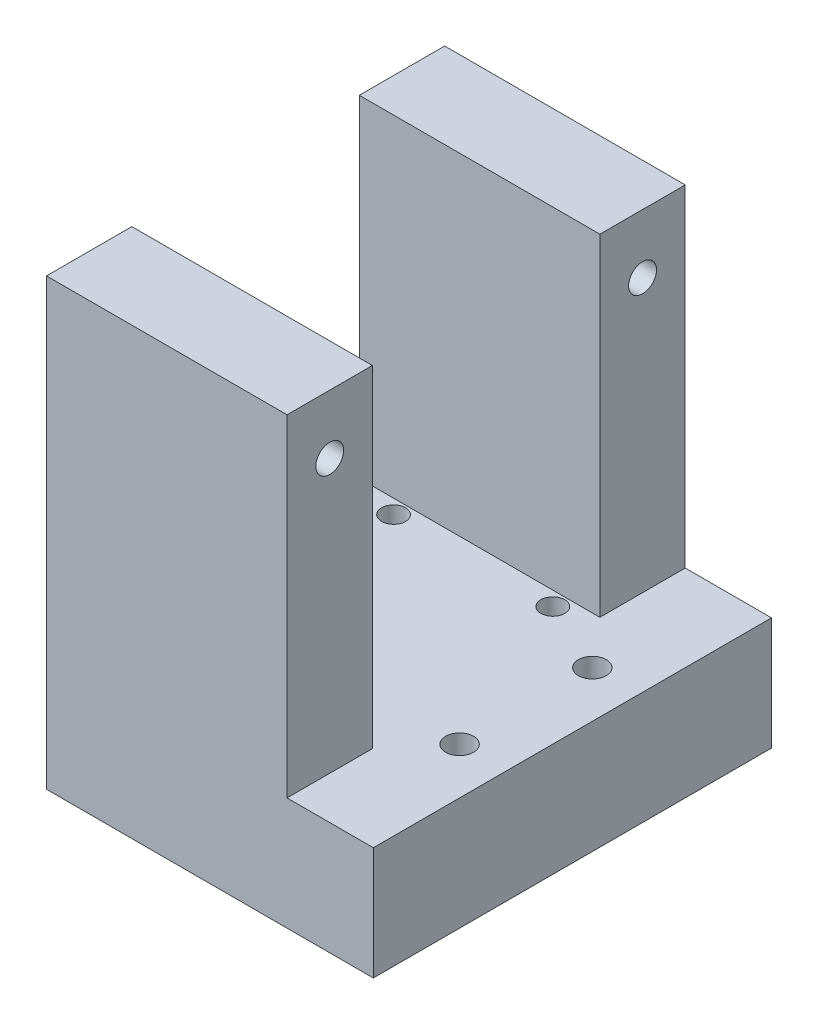
ISO-10303-21;
HEADER;
FILE_DESCRIPTION(('STEP AP214'),'2;1');
FILE_NAME('part.step','',(''),(''),'','','');
FILE_SCHEMA(('AUTOMOTIVE_DESIGN { 1 0 10303 214 1 1 1 1 }'));
ENDSEC;
DATA;
#1=APPLICATION_CONTEXT('core data for automotive mechanical design processes');
#2=APPLICATION_PROTOCOL_DEFINITION('international standard','automotive_design',2000,#1);
#3=PRODUCT_CONTEXT('',#1,'mechanical');
#4=PRODUCT('Part','Part','',(#3));
#5=PRODUCT_RELATED_PRODUCT_CATEGORY('part','',(#4));
#6=PRODUCT_DEFINITION_FORMATION('','',#4);
#7=PRODUCT_DEFINITION_CONTEXT('part definition',#1,'design');
#8=PRODUCT_DEFINITION('design','',#6,#7);
#9=PRODUCT_DEFINITION_SHAPE('','',#8);
#10=(LENGTH_UNIT() NAMED_UNIT(*) SI_UNIT(.MILLI.,.METRE.));
#11=(NAMED_UNIT(*) PLANE_ANGLE_UNIT() SI_UNIT($,.RADIAN.));
#12=(NAMED_UNIT(*) SI_UNIT($,.STERADIAN.) SOLID_ANGLE_UNIT());
#13=UNCERTAINTY_MEASURE_WITH_UNIT(LENGTH_MEASURE(1.E-05),#10,'distance_accuracy_value','');
#14=(GEOMETRIC_REPRESENTATION_CONTEXT(3) GLOBAL_UNCERTAINTY_ASSIGNED_CONTEXT((#13)) GLOBAL_UNIT_ASSIGNED_CONTEXT((#10,
#11,#12)) REPRESENTATION_CONTEXT('',''));
#15=CARTESIAN_POINT('',(0.,0.,0.));
#16=DIRECTION('',(0.,0.,1.));
#17=DIRECTION('',(1.,0.,0.));
#18=AXIS2_PLACEMENT_3D('',#15,#16,#17);
#19=CARTESIAN_POINT('',(0.,17.,0.));
#20=DIRECTION('',(0.,1.,0.));
#21=DIRECTION('',(0.,0.,1.));
#22=AXIS2_PLACEMENT_3D('',#19,#20,#21);
#23=PLANE('',#22);
#24=CARTESIAN_POINT('',(7.3,17.,-35.));
#25=DIRECTION('',(0.,1.,0.));
#26=DIRECTION('',(0.,0.,-1.));
#27=AXIS2_PLACEMENT_3D('',#24,#25,#26);
#28=CIRCLE('',#27,1.8);
#29=CARTESIAN_POINT('',(7.3,17.,-36.8));
#30=VERTEX_POINT('',#29);
#31=EDGE_CURVE('E244',#30,#30,#28,.T.);
#32=ORIENTED_EDGE('',*,*,#31,.F.);
#33=EDGE_LOOP('',(#32));
#34=FACE_BOUND('',#33,.T.);
#35=CARTESIAN_POINT('',(31.3,17.,-5.));
#36=DIRECTION('',(0.,1.,0.));
#37=DIRECTION('',(0.,0.,1.));
#38=AXIS2_PLACEMENT_3D('',#35,#36,#37);
#39=CIRCLE('',#38,1.8);
#40=CARTESIAN_POINT('',(31.3,17.,-3.2));
#41=VERTEX_POINT('',#40);
#42=EDGE_CURVE('E260',#41,#41,#39,.T.);
#43=ORIENTED_EDGE('',*,*,#42,.F.);
#44=EDGE_LOOP('',(#43));
#45=FACE_BOUND('',#44,.T.);
#46=CARTESIAN_POINT('',(7.3,17.,-5.));
#47=DIRECTION('',(0.,1.,0.));
#48=DIRECTION('',(0.,0.,1.));
#49=AXIS2_PLACEMENT_3D('',#46,#47,#48);
#50=CIRCLE('',#49,1.8);
#51=CARTESIAN_POINT('',(7.3,17.,-3.2));
#52=VERTEX_POINT('',#51);
#53=EDGE_CURVE('E276',#52,#52,#50,.T.);
#54=ORIENTED_EDGE('',*,*,#53,.F.);
#55=EDGE_LOOP('',(#54));
#56=FACE_BOUND('',#55,.T.);
#57=CARTESIAN_POINT('',(42.25,17.,-30.));
#58=DIRECTION('',(0.,1.,0.));
#59=DIRECTION('',(0.,0.,1.));
#60=AXIS2_PLACEMENT_3D('',#57,#58,#59);
#61=CIRCLE('',#60,2.1);
#62=CARTESIAN_POINT('',(42.25,17.,-27.9));
#63=VERTEX_POINT('',#62);
#64=EDGE_CURVE('E268',#63,#63,#61,.T.);
#65=ORIENTED_EDGE('',*,*,#64,.F.);
#66=EDGE_LOOP('',(#65));
#67=FACE_BOUND('',#66,.T.);
#68=CARTESIAN_POINT('',(31.3,17.,-35.));
#69=DIRECTION('',(0.,1.,0.));
#70=DIRECTION('',(0.,0.,-1.));
#71=AXIS2_PLACEMENT_3D('',#68,#69,#70);
#72=CIRCLE('',#71,1.8);
#73=CARTESIAN_POINT('',(31.3,17.,-36.8));
#74=VERTEX_POINT('',#73);
#75=EDGE_CURVE('E252',#74,#74,#72,.T.);
#76=ORIENTED_EDGE('',*,*,#75,.F.);
#77=EDGE_LOOP('',(#76));
#78=FACE_BOUND('',#77,.T.);
#79=CARTESIAN_POINT('',(42.25,17.,-10.));
#80=DIRECTION('',(0.,1.,0.));
#81=DIRECTION('',(0.,0.,1.));
#82=AXIS2_PLACEMENT_3D('',#79,#80,#81);
#83=CIRCLE('',#82,2.1);
#84=CARTESIAN_POINT('',(42.25,17.,-7.9));
#85=VERTEX_POINT('',#84);
#86=EDGE_CURVE('E236',#85,#85,#83,.T.);
#87=ORIENTED_EDGE('',*,*,#86,.F.);
#88=EDGE_LOOP('',(#87));
#89=FACE_BOUND('',#88,.T.);
#90=DIRECTION('',(-1.,0.,0.));
#91=VECTOR('',#90,1.);
#92=CARTESIAN_POINT('',(0.,17.,-2.86));
#93=LINE('',#92,#91);
#94=CARTESIAN_POINT('',(36.25,17.,-2.86));
#95=VERTEX_POINT('',#94);
#96=CARTESIAN_POINT('',(0.,17.,-2.86));
#97=VERTEX_POINT('',#96);
#98=EDGE_CURVE('E58',#95,#97,#93,.T.);
#99=ORIENTED_EDGE('',*,*,#98,.F.);
#100=DIRECTION('',(0.,0.,-1.));
#101=VECTOR('',#100,1.);
#102=CARTESIAN_POINT('',(36.25,17.,-2.86));
#103=LINE('',#102,#101);
#104=CARTESIAN_POINT('',(36.25,17.,10.));
#105=VERTEX_POINT('',#104);
#106=EDGE_CURVE('E176',#105,#95,#103,.T.);
#107=ORIENTED_EDGE('',*,*,#106,.F.);
#108=DIRECTION('',(1.,0.,0.));
#109=VECTOR('',#108,1.);
#110=CARTESIAN_POINT('',(0.,17.,10.));
#111=LINE('',#110,#109);
#112=CARTESIAN_POINT('',(49.25,17.,10.));
#113=VERTEX_POINT('',#112);
#114=EDGE_CURVE('E134',#105,#113,#111,.T.);
#115=ORIENTED_EDGE('',*,*,#114,.T.);
#116=DIRECTION('',(0.,0.,1.));
#117=VECTOR('',#116,1.);
#118=CARTESIAN_POINT('',(49.25,17.,10.));
#119=LINE('',#118,#117);
#120=CARTESIAN_POINT('',(49.25,17.,-50.));
#121=VERTEX_POINT('',#120);
#122=EDGE_CURVE('E133',#121,#113,#119,.T.);
#123=ORIENTED_EDGE('',*,*,#122,.F.);
#124=DIRECTION('',(-1.,0.,0.));
#125=VECTOR('',#124,1.);
#126=CARTESIAN_POINT('',(48.25,17.,-50.));
#127=LINE('',#126,#125);
#128=CARTESIAN_POINT('',(36.25,17.,-50.));
#129=VERTEX_POINT('',#128);
#130=EDGE_CURVE('E118',#121,#129,#127,.T.);
#131=ORIENTED_EDGE('',*,*,#130,.T.);
#132=DIRECTION('',(0.,0.,-1.));
#133=VECTOR('',#132,1.);
#134=CARTESIAN_POINT('',(36.25,17.,-50.));
#135=LINE('',#134,#133);
#136=CARTESIAN_POINT('',(36.25,17.,-37.14));
#137=VERTEX_POINT('',#136);
#138=EDGE_CURVE('E198',#137,#129,#135,.T.);
#139=ORIENTED_EDGE('',*,*,#138,.F.);
#140=DIRECTION('',(1.,0.,0.));
#141=VECTOR('',#140,1.);
#142=CARTESIAN_POINT('',(0.,17.,-37.14));
#143=LINE('',#142,#141);
#144=CARTESIAN_POINT('',(0.,17.,-37.14));
#145=VERTEX_POINT('',#144);
#146=EDGE_CURVE('E192',#145,#137,#143,.T.);
#147=ORIENTED_EDGE('',*,*,#146,.F.);
#148=DIRECTION('',(0.,0.,1.));
#149=VECTOR('',#148,1.);
#150=CARTESIAN_POINT('',(0.,17.,-40.));
#151=LINE('',#150,#149);
#152=EDGE_CURVE('E11',#145,#97,#151,.T.);
#153=ORIENTED_EDGE('',*,*,#152,.T.);
#154=EDGE_LOOP('',(#99,#107,#115,#123,#131,#139,#147,#153));
#155=FACE_BOUND('',#154,.T.);
#156=ADVANCED_FACE('F41',(#34,#45,#56,#67,#78,#89,#155),#23,.T.);
#157=CARTESIAN_POINT('',(0.,0.,0.));
#158=DIRECTION('',(0.,1.,0.));
#159=DIRECTION('',(0.,0.,1.));
#160=AXIS2_PLACEMENT_3D('',#157,#158,#159);
#161=PLANE('',#160);
#162=DIRECTION('',(0.,0.,1.));
#163=VECTOR('',#162,1.);
#164=CARTESIAN_POINT('',(0.,0.,-40.));
#165=LINE('',#164,#163);
#166=CARTESIAN_POINT('',(0.,0.,-50.));
#167=VERTEX_POINT('',#166);
#168=CARTESIAN_POINT('',(0.,0.,10.));
#169=VERTEX_POINT('',#168);
#170=EDGE_CURVE('E51',#167,#169,#165,.T.);
#171=ORIENTED_EDGE('',*,*,#170,.F.);
#172=DIRECTION('',(-1.,0.,0.));
#173=VECTOR('',#172,1.);
#174=CARTESIAN_POINT('',(48.25,0.,-50.));
#175=LINE('',#174,#173);
#176=CARTESIAN_POINT('',(49.25,0.,-50.));
#177=VERTEX_POINT('',#176);
#178=EDGE_CURVE('E129',#177,#167,#175,.T.);
#179=ORIENTED_EDGE('',*,*,#178,.F.);
#180=DIRECTION('',(0.,0.,-1.));
#181=VECTOR('',#180,1.);
#182=CARTESIAN_POINT('',(49.25,0.,-50.));
#183=LINE('',#182,#181);
#184=CARTESIAN_POINT('',(49.25,0.,10.));
#185=VERTEX_POINT('',#184);
#186=EDGE_CURVE('E144',#185,#177,#183,.T.);
#187=ORIENTED_EDGE('',*,*,#186,.F.);
#188=DIRECTION('',(1.,0.,0.));
#189=VECTOR('',#188,1.);
#190=CARTESIAN_POINT('',(0.,0.,10.));
#191=LINE('',#190,#189);
#192=EDGE_CURVE('E223',#169,#185,#191,.T.);
#193=ORIENTED_EDGE('',*,*,#192,.F.);
#194=EDGE_LOOP('',(#171,#179,#187,#193));
#195=FACE_BOUND('',#194,.T.);
#196=CARTESIAN_POINT('',(7.3,0.,-5.));
#197=DIRECTION('',(0.,1.,0.));
#198=DIRECTION('',(0.,0.,1.));
#199=AXIS2_PLACEMENT_3D('',#196,#197,#198);
#200=CIRCLE('',#199,1.8);
#201=CARTESIAN_POINT('',(7.3,0.,-3.2));
#202=VERTEX_POINT('',#201);
#203=EDGE_CURVE('E272',#202,#202,#200,.T.);
#204=ORIENTED_EDGE('',*,*,#203,.T.);
#205=EDGE_LOOP('',(#204));
#206=FACE_BOUND('',#205,.T.);
#207=CARTESIAN_POINT('',(42.25,0.,-30.));
#208=DIRECTION('',(0.,1.,0.));
#209=DIRECTION('',(0.,0.,1.));
#210=AXIS2_PLACEMENT_3D('',#207,#208,#209);
#211=CIRCLE('',#210,2.1);
#212=CARTESIAN_POINT('',(42.25,0.,-27.9));
#213=VERTEX_POINT('',#212);
#214=EDGE_CURVE('E264',#213,#213,#211,.T.);
#215=ORIENTED_EDGE('',*,*,#214,.T.);
#216=EDGE_LOOP('',(#215));
#217=FACE_BOUND('',#216,.T.);
#218=CARTESIAN_POINT('',(31.3,0.,-5.));
#219=DIRECTION('',(0.,1.,0.));
#220=DIRECTION('',(0.,0.,1.));
#221=AXIS2_PLACEMENT_3D('',#218,#219,#220);
#222=CIRCLE('',#221,1.8);
#223=CARTESIAN_POINT('',(31.3,0.,-3.2));
#224=VERTEX_POINT('',#223);
#225=EDGE_CURVE('E256',#224,#224,#222,.T.);
#226=ORIENTED_EDGE('',*,*,#225,.T.);
#227=EDGE_LOOP('',(#226));
#228=FACE_BOUND('',#227,.T.);
#229=CARTESIAN_POINT('',(31.3,0.,-35.));
#230=DIRECTION('',(0.,1.,0.));
#231=DIRECTION('',(0.,0.,-1.));
#232=AXIS2_PLACEMENT_3D('',#229,#230,#231);
#233=CIRCLE('',#232,1.8);
#234=CARTESIAN_POINT('',(31.3,0.,-36.8));
#235=VERTEX_POINT('',#234);
#236=EDGE_CURVE('E248',#235,#235,#233,.T.);
#237=ORIENTED_EDGE('',*,*,#236,.T.);
#238=EDGE_LOOP('',(#237));
#239=FACE_BOUND('',#238,.T.);
#240=CARTESIAN_POINT('',(7.3,0.,-35.));
#241=DIRECTION('',(0.,1.,0.));
#242=DIRECTION('',(0.,0.,-1.));
#243=AXIS2_PLACEMENT_3D('',#240,#241,#242);
#244=CIRCLE('',#243,1.8);
#245=CARTESIAN_POINT('',(7.3,0.,-36.8));
#246=VERTEX_POINT('',#245);
#247=EDGE_CURVE('E240',#246,#246,#244,.T.);
#248=ORIENTED_EDGE('',*,*,#247,.T.);
#249=EDGE_LOOP('',(#248));
#250=FACE_BOUND('',#249,.T.);
#251=CARTESIAN_POINT('',(42.25,0.,-10.));
#252=DIRECTION('',(0.,1.,0.));
#253=DIRECTION('',(0.,0.,1.));
#254=AXIS2_PLACEMENT_3D('',#251,#252,#253);
#255=CIRCLE('',#254,2.1);
#256=CARTESIAN_POINT('',(42.25,0.,-7.9));
#257=VERTEX_POINT('',#256);
#258=EDGE_CURVE('E235',#257,#257,#255,.T.);
#259=ORIENTED_EDGE('',*,*,#258,.T.);
#260=EDGE_LOOP('',(#259));
#261=FACE_BOUND('',#260,.T.);
#262=ADVANCED_FACE('F309',(#195,#206,#217,#228,#239,#250,#261),#161,.F.);
#263=CARTESIAN_POINT('',(0.,17.,-40.));
#264=DIRECTION('',(1.,0.,0.));
#265=DIRECTION('',(0.,0.,-1.));
#266=AXIS2_PLACEMENT_3D('',#263,#264,#265);
#267=PLANE('',#266);
#268=CARTESIAN_POINT('',(0.,58.1,-43.57));
#269=DIRECTION('',(-1.,0.,0.));
#270=DIRECTION('',(0.,0.,1.));
#271=AXIS2_PLACEMENT_3D('',#268,#269,#270);
#272=CIRCLE('',#271,2.1);
#273=CARTESIAN_POINT('',(0.,58.1,-41.47));
#274=VERTEX_POINT('',#273);
#275=EDGE_CURVE('E153',#274,#274,#272,.T.);
#276=ORIENTED_EDGE('',*,*,#275,.F.);
#277=EDGE_LOOP('',(#276));
#278=FACE_BOUND('',#277,.T.);
#279=CARTESIAN_POINT('',(0.,58.1,3.57));
#280=DIRECTION('',(-1.,0.,0.));
#281=DIRECTION('',(0.,0.,-1.));
#282=AXIS2_PLACEMENT_3D('',#279,#280,#281);
#283=CIRCLE('',#282,2.1);
#284=CARTESIAN_POINT('',(0.,58.1,1.47000000000001));
#285=VERTEX_POINT('',#284);
#286=EDGE_CURVE('E152',#285,#285,#283,.T.);
#287=ORIENTED_EDGE('',*,*,#286,.F.);
#288=EDGE_LOOP('',(#287));
#289=FACE_BOUND('',#288,.T.);
#290=ORIENTED_EDGE('',*,*,#170,.T.);
#291=DIRECTION('',(0.,1.,0.));
#292=VECTOR('',#291,1.);
#293=CARTESIAN_POINT('',(0.,0.,10.));
#294=LINE('',#293,#292);
#295=CARTESIAN_POINT('',(0.,67.,10.));
#296=VERTEX_POINT('',#295);
#297=EDGE_CURVE('E130',#169,#296,#294,.T.);
#298=ORIENTED_EDGE('',*,*,#297,.T.);
#299=DIRECTION('',(0.,0.,1.));
#300=VECTOR('',#299,1.);
#301=CARTESIAN_POINT('',(0.,67.,10.));
#302=LINE('',#301,#300);
#303=CARTESIAN_POINT('',(0.,67.,-2.86));
#304=VERTEX_POINT('',#303);
#305=EDGE_CURVE('E171',#304,#296,#302,.T.);
#306=ORIENTED_EDGE('',*,*,#305,.F.);
#307=DIRECTION('',(0.,-1.,0.));
#308=VECTOR('',#307,1.);
#309=CARTESIAN_POINT('',(0.,67.,-2.86));
#310=LINE('',#309,#308);
#311=EDGE_CURVE('E175',#304,#97,#310,.T.);
#312=ORIENTED_EDGE('',*,*,#311,.T.);
#313=ORIENTED_EDGE('',*,*,#152,.F.);
#314=DIRECTION('',(0.,-1.,0.));
#315=VECTOR('',#314,1.);
#316=CARTESIAN_POINT('',(0.,67.,-37.14));
#317=LINE('',#316,#315);
#318=CARTESIAN_POINT('',(0.,67.,-37.14));
#319=VERTEX_POINT('',#318);
#320=EDGE_CURVE('E219',#319,#145,#317,.T.);
#321=ORIENTED_EDGE('',*,*,#320,.F.);
#322=DIRECTION('',(0.,0.,1.));
#323=VECTOR('',#322,1.);
#324=CARTESIAN_POINT('',(0.,67.,-50.));
#325=LINE('',#324,#323);
#326=CARTESIAN_POINT('',(0.,67.,-50.));
#327=VERTEX_POINT('',#326);
#328=EDGE_CURVE('E193',#327,#319,#325,.T.);
#329=ORIENTED_EDGE('',*,*,#328,.F.);
#330=DIRECTION('',(0.,1.,0.));
#331=VECTOR('',#330,1.);
#332=CARTESIAN_POINT('',(0.,0.,-50.));
#333=LINE('',#332,#331);
#334=EDGE_CURVE('E231',#167,#327,#333,.T.);
#335=ORIENTED_EDGE('',*,*,#334,.F.);
#336=EDGE_LOOP('',(#290,#298,#306,#312,#313,#321,#329,#335));
#337=FACE_BOUND('',#336,.T.);
#338=ADVANCED_FACE('F43',(#278,#289,#337),#267,.F.);
#339=CARTESIAN_POINT('',(7.3,17.,-5.));
#340=DIRECTION('',(0.,-1.,0.));
#341=DIRECTION('',(0.,0.,-1.));
#342=AXIS2_PLACEMENT_3D('',#339,#340,#341);
#343=CYLINDRICAL_SURFACE('',#342,1.8);
#344=ORIENTED_EDGE('',*,*,#53,.T.);
#345=EDGE_LOOP('',(#344));
#346=FACE_BOUND('',#345,.T.);
#347=ORIENTED_EDGE('',*,*,#203,.F.);
#348=EDGE_LOOP('',(#347));
#349=FACE_BOUND('',#348,.T.);
#350=ADVANCED_FACE('F319',(#346,#349),#343,.F.);
#351=CARTESIAN_POINT('',(42.25,17.,-30.));
#352=DIRECTION('',(0.,-1.,0.));
#353=DIRECTION('',(0.,0.,-1.));
#354=AXIS2_PLACEMENT_3D('',#351,#352,#353);
#355=CYLINDRICAL_SURFACE('',#354,2.1);
#356=ORIENTED_EDGE('',*,*,#64,.T.);
#357=EDGE_LOOP('',(#356));
#358=FACE_BOUND('',#357,.T.);
#359=ORIENTED_EDGE('',*,*,#214,.F.);
#360=EDGE_LOOP('',(#359));
#361=FACE_BOUND('',#360,.T.);
#362=ADVANCED_FACE('F322',(#358,#361),#355,.F.);
#363=CARTESIAN_POINT('',(31.3,17.,-5.));
#364=DIRECTION('',(0.,-1.,0.));
#365=DIRECTION('',(0.,0.,-1.));
#366=AXIS2_PLACEMENT_3D('',#363,#364,#365);
#367=CYLINDRICAL_SURFACE('',#366,1.8);
#368=ORIENTED_EDGE('',*,*,#42,.T.);
#369=EDGE_LOOP('',(#368));
#370=FACE_BOUND('',#369,.T.);
#371=ORIENTED_EDGE('',*,*,#225,.F.);
#372=EDGE_LOOP('',(#371));
#373=FACE_BOUND('',#372,.T.);
#374=ADVANCED_FACE('F326',(#370,#373),#367,.F.);
#375=CARTESIAN_POINT('',(31.3,17.,-35.));
#376=DIRECTION('',(0.,-1.,0.));
#377=DIRECTION('',(0.,0.,-1.));
#378=AXIS2_PLACEMENT_3D('',#375,#376,#377);
#379=CYLINDRICAL_SURFACE('',#378,1.8);
#380=ORIENTED_EDGE('',*,*,#75,.T.);
#381=EDGE_LOOP('',(#380));
#382=FACE_BOUND('',#381,.T.);
#383=ORIENTED_EDGE('',*,*,#236,.F.);
#384=EDGE_LOOP('',(#383));
#385=FACE_BOUND('',#384,.T.);
#386=ADVANCED_FACE('F330',(#382,#385),#379,.F.);
#387=CARTESIAN_POINT('',(7.3,17.,-35.));
#388=DIRECTION('',(0.,-1.,0.));
#389=DIRECTION('',(0.,0.,-1.));
#390=AXIS2_PLACEMENT_3D('',#387,#388,#389);
#391=CYLINDRICAL_SURFACE('',#390,1.8);
#392=ORIENTED_EDGE('',*,*,#31,.T.);
#393=EDGE_LOOP('',(#392));
#394=FACE_BOUND('',#393,.T.);
#395=ORIENTED_EDGE('',*,*,#247,.F.);
#396=EDGE_LOOP('',(#395));
#397=FACE_BOUND('',#396,.T.);
#398=ADVANCED_FACE('F334',(#394,#397),#391,.F.);
#399=CARTESIAN_POINT('',(42.25,17.,-10.));
#400=DIRECTION('',(0.,-1.,0.));
#401=DIRECTION('',(0.,0.,-1.));
#402=AXIS2_PLACEMENT_3D('',#399,#400,#401);
#403=CYLINDRICAL_SURFACE('',#402,2.1);
#404=ORIENTED_EDGE('',*,*,#86,.T.);
#405=EDGE_LOOP('',(#404));
#406=FACE_BOUND('',#405,.T.);
#407=ORIENTED_EDGE('',*,*,#258,.F.);
#408=EDGE_LOOP('',(#407));
#409=FACE_BOUND('',#408,.T.);
#410=ADVANCED_FACE('F338',(#406,#409),#403,.F.);
#411=CARTESIAN_POINT('',(48.25,0.,-50.));
#412=DIRECTION('',(0.,0.,-1.));
#413=DIRECTION('',(-1.,0.,0.));
#414=AXIS2_PLACEMENT_3D('',#411,#412,#413);
#415=PLANE('',#414);
#416=ORIENTED_EDGE('',*,*,#130,.F.);
#417=DIRECTION('',(0.,1.,0.));
#418=VECTOR('',#417,1.);
#419=CARTESIAN_POINT('',(49.25,17.,-50.));
#420=LINE('',#419,#418);
#421=EDGE_CURVE('E123',#177,#121,#420,.T.);
#422=ORIENTED_EDGE('',*,*,#421,.F.);
#423=ORIENTED_EDGE('',*,*,#178,.T.);
#424=ORIENTED_EDGE('',*,*,#334,.T.);
#425=DIRECTION('',(-1.,0.,0.));
#426=VECTOR('',#425,1.);
#427=CARTESIAN_POINT('',(0.,67.,-50.));
#428=LINE('',#427,#426);
#429=CARTESIAN_POINT('',(36.25,67.,-50.));
#430=VERTEX_POINT('',#429);
#431=EDGE_CURVE('E204',#430,#327,#428,.T.);
#432=ORIENTED_EDGE('',*,*,#431,.F.);
#433=DIRECTION('',(0.,-1.,0.));
#434=VECTOR('',#433,1.);
#435=CARTESIAN_POINT('',(36.25,67.,-50.));
#436=LINE('',#435,#434);
#437=EDGE_CURVE('E126',#430,#129,#436,.T.);
#438=ORIENTED_EDGE('',*,*,#437,.T.);
#439=EDGE_LOOP('',(#416,#422,#423,#424,#432,#438));
#440=FACE_BOUND('',#439,.T.);
#441=ADVANCED_FACE('F120',(#440),#415,.T.);
#442=CARTESIAN_POINT('',(0.,0.,10.));
#443=DIRECTION('',(0.,0.,1.));
#444=DIRECTION('',(1.,0.,0.));
#445=AXIS2_PLACEMENT_3D('',#442,#443,#444);
#446=PLANE('',#445);
#447=ORIENTED_EDGE('',*,*,#114,.F.);
#448=DIRECTION('',(0.,-1.,0.));
#449=VECTOR('',#448,1.);
#450=CARTESIAN_POINT('',(36.25,67.,10.));
#451=LINE('',#450,#449);
#452=CARTESIAN_POINT('',(36.25,67.,10.));
#453=VERTEX_POINT('',#452);
#454=EDGE_CURVE('E188',#453,#105,#451,.T.);
#455=ORIENTED_EDGE('',*,*,#454,.F.);
#456=DIRECTION('',(1.,0.,0.));
#457=VECTOR('',#456,1.);
#458=CARTESIAN_POINT('',(36.25,67.,10.));
#459=LINE('',#458,#457);
#460=EDGE_CURVE('E161',#296,#453,#459,.T.);
#461=ORIENTED_EDGE('',*,*,#460,.F.);
#462=ORIENTED_EDGE('',*,*,#297,.F.);
#463=ORIENTED_EDGE('',*,*,#192,.T.);
#464=DIRECTION('',(0.,-1.,0.));
#465=VECTOR('',#464,1.);
#466=CARTESIAN_POINT('',(49.25,0.,10.));
#467=LINE('',#466,#465);
#468=EDGE_CURVE('E139',#113,#185,#467,.T.);
#469=ORIENTED_EDGE('',*,*,#468,.F.);
#470=EDGE_LOOP('',(#447,#455,#461,#462,#463,#469));
#471=FACE_BOUND('',#470,.T.);
#472=ADVANCED_FACE('F345',(#471),#446,.T.);
#473=CARTESIAN_POINT('',(0.,67.,-37.14));
#474=DIRECTION('',(0.,0.,-1.));
#475=DIRECTION('',(-1.,0.,0.));
#476=AXIS2_PLACEMENT_3D('',#473,#474,#475);
#477=PLANE('',#476);
#478=ORIENTED_EDGE('',*,*,#146,.T.);
#479=DIRECTION('',(0.,-1.,0.));
#480=VECTOR('',#479,1.);
#481=CARTESIAN_POINT('',(36.25,67.,-37.14));
#482=LINE('',#481,#480);
#483=CARTESIAN_POINT('',(36.25,67.,-37.14));
#484=VERTEX_POINT('',#483);
#485=EDGE_CURVE('E215',#484,#137,#482,.T.);
#486=ORIENTED_EDGE('',*,*,#485,.F.);
#487=DIRECTION('',(1.,0.,0.));
#488=VECTOR('',#487,1.);
#489=CARTESIAN_POINT('',(0.,67.,-37.14));
#490=LINE('',#489,#488);
#491=EDGE_CURVE('E197',#319,#484,#490,.T.);
#492=ORIENTED_EDGE('',*,*,#491,.F.);
#493=ORIENTED_EDGE('',*,*,#320,.T.);
#494=EDGE_LOOP('',(#478,#486,#492,#493));
#495=FACE_BOUND('',#494,.T.);
#496=ADVANCED_FACE('F348',(#495),#477,.F.);
#497=CARTESIAN_POINT('',(36.25,67.,-50.));
#498=DIRECTION('',(-1.,0.,0.));
#499=DIRECTION('',(0.,0.,1.));
#500=AXIS2_PLACEMENT_3D('',#497,#498,#499);
#501=PLANE('',#500);
#502=CARTESIAN_POINT('',(36.25,58.1,-43.57));
#503=DIRECTION('',(-1.,0.,0.));
#504=DIRECTION('',(0.,0.,1.));
#505=AXIS2_PLACEMENT_3D('',#502,#503,#504);
#506=CIRCLE('',#505,2.1);
#507=CARTESIAN_POINT('',(36.25,58.1,-41.47));
#508=VERTEX_POINT('',#507);
#509=EDGE_CURVE('E45',#508,#508,#506,.T.);
#510=ORIENTED_EDGE('',*,*,#509,.T.);
#511=EDGE_LOOP('',(#510));
#512=FACE_BOUND('',#511,.T.);
#513=ORIENTED_EDGE('',*,*,#138,.T.);
#514=ORIENTED_EDGE('',*,*,#437,.F.);
#515=DIRECTION('',(0.,0.,-1.));
#516=VECTOR('',#515,1.);
#517=CARTESIAN_POINT('',(36.25,67.,-50.));
#518=LINE('',#517,#516);
#519=EDGE_CURVE('E201',#484,#430,#518,.T.);
#520=ORIENTED_EDGE('',*,*,#519,.F.);
#521=ORIENTED_EDGE('',*,*,#485,.T.);
#522=EDGE_LOOP('',(#513,#514,#520,#521));
#523=FACE_BOUND('',#522,.T.);
#524=ADVANCED_FACE('F292',(#512,#523),#501,.F.);
#525=CARTESIAN_POINT('',(0.,67.,0.));
#526=DIRECTION('',(0.,1.,0.));
#527=DIRECTION('',(0.,0.,1.));
#528=AXIS2_PLACEMENT_3D('',#525,#526,#527);
#529=PLANE('',#528);
#530=ORIENTED_EDGE('',*,*,#328,.T.);
#531=ORIENTED_EDGE('',*,*,#491,.T.);
#532=ORIENTED_EDGE('',*,*,#519,.T.);
#533=ORIENTED_EDGE('',*,*,#431,.T.);
#534=EDGE_LOOP('',(#530,#531,#532,#533));
#535=FACE_BOUND('',#534,.T.);
#536=ADVANCED_FACE('F355',(#535),#529,.T.);
#537=CARTESIAN_POINT('',(36.25,67.,-2.86));
#538=DIRECTION('',(-1.,0.,0.));
#539=DIRECTION('',(0.,0.,1.));
#540=AXIS2_PLACEMENT_3D('',#537,#538,#539);
#541=PLANE('',#540);
#542=CARTESIAN_POINT('',(36.25,58.1,3.57));
#543=DIRECTION('',(-1.,0.,0.));
#544=DIRECTION('',(0.,0.,1.));
#545=AXIS2_PLACEMENT_3D('',#542,#543,#544);
#546=CIRCLE('',#545,2.1);
#547=CARTESIAN_POINT('',(36.25,58.1,5.67));
#548=VERTEX_POINT('',#547);
#549=EDGE_CURVE('E157',#548,#548,#546,.T.);
#550=ORIENTED_EDGE('',*,*,#549,.T.);
#551=EDGE_LOOP('',(#550));
#552=FACE_BOUND('',#551,.T.);
#553=ORIENTED_EDGE('',*,*,#106,.T.);
#554=DIRECTION('',(0.,-1.,0.));
#555=VECTOR('',#554,1.);
#556=CARTESIAN_POINT('',(36.25,67.,-2.86));
#557=LINE('',#556,#555);
#558=CARTESIAN_POINT('',(36.25,67.,-2.86));
#559=VERTEX_POINT('',#558);
#560=EDGE_CURVE('E184',#559,#95,#557,.T.);
#561=ORIENTED_EDGE('',*,*,#560,.F.);
#562=DIRECTION('',(0.,0.,-1.));
#563=VECTOR('',#562,1.);
#564=CARTESIAN_POINT('',(36.25,67.,-2.86));
#565=LINE('',#564,#563);
#566=EDGE_CURVE('E165',#453,#559,#565,.T.);
#567=ORIENTED_EDGE('',*,*,#566,.F.);
#568=ORIENTED_EDGE('',*,*,#454,.T.);
#569=EDGE_LOOP('',(#553,#561,#567,#568));
#570=FACE_BOUND('',#569,.T.);
#571=ADVANCED_FACE('F358',(#552,#570),#541,.F.);
#572=CARTESIAN_POINT('',(0.,67.,-2.86));
#573=DIRECTION('',(0.,0.,1.));
#574=DIRECTION('',(1.,0.,0.));
#575=AXIS2_PLACEMENT_3D('',#572,#573,#574);
#576=PLANE('',#575);
#577=ORIENTED_EDGE('',*,*,#98,.T.);
#578=ORIENTED_EDGE('',*,*,#311,.F.);
#579=DIRECTION('',(-1.,0.,0.));
#580=VECTOR('',#579,1.);
#581=CARTESIAN_POINT('',(0.,67.,-2.86));
#582=LINE('',#581,#580);
#583=EDGE_CURVE('E168',#559,#304,#582,.T.);
#584=ORIENTED_EDGE('',*,*,#583,.F.);
#585=ORIENTED_EDGE('',*,*,#560,.T.);
#586=EDGE_LOOP('',(#577,#578,#584,#585));
#587=FACE_BOUND('',#586,.T.);
#588=ADVANCED_FACE('F362',(#587),#576,.F.);
#589=CARTESIAN_POINT('',(0.,67.,0.));
#590=DIRECTION('',(0.,-1.,0.));
#591=DIRECTION('',(0.,0.,-1.));
#592=AXIS2_PLACEMENT_3D('',#589,#590,#591);
#593=PLANE('',#592);
#594=ORIENTED_EDGE('',*,*,#460,.T.);
#595=ORIENTED_EDGE('',*,*,#566,.T.);
#596=ORIENTED_EDGE('',*,*,#583,.T.);
#597=ORIENTED_EDGE('',*,*,#305,.T.);
#598=EDGE_LOOP('',(#594,#595,#596,#597));
#599=FACE_BOUND('',#598,.T.);
#600=ADVANCED_FACE('F305',(#599),#593,.F.);
#601=CARTESIAN_POINT('',(50.,58.1,3.57));
#602=DIRECTION('',(-1.,0.,0.));
#603=DIRECTION('',(0.,0.,1.));
#604=AXIS2_PLACEMENT_3D('',#601,#602,#603);
#605=CYLINDRICAL_SURFACE('',#604,2.1);
#606=ORIENTED_EDGE('',*,*,#286,.T.);
#607=EDGE_LOOP('',(#606));
#608=FACE_BOUND('',#607,.T.);
#609=ORIENTED_EDGE('',*,*,#549,.F.);
#610=EDGE_LOOP('',(#609));
#611=FACE_BOUND('',#610,.T.);
#612=ADVANCED_FACE('F297',(#608,#611),#605,.F.);
#613=CARTESIAN_POINT('',(50.,58.1,-43.57));
#614=DIRECTION('',(-1.,0.,0.));
#615=DIRECTION('',(0.,0.,1.));
#616=AXIS2_PLACEMENT_3D('',#613,#614,#615);
#617=CYLINDRICAL_SURFACE('',#616,2.1);
#618=ORIENTED_EDGE('',*,*,#275,.T.);
#619=EDGE_LOOP('',(#618));
#620=FACE_BOUND('',#619,.T.);
#621=ORIENTED_EDGE('',*,*,#509,.F.);
#622=EDGE_LOOP('',(#621));
#623=FACE_BOUND('',#622,.T.);
#624=ADVANCED_FACE('F295',(#620,#623),#617,.F.);
#625=CARTESIAN_POINT('',(49.25,0.,0.));
#626=DIRECTION('',(-1.,0.,0.));
#627=DIRECTION('',(0.,0.,1.));
#628=AXIS2_PLACEMENT_3D('',#625,#626,#627);
#629=PLANE('',#628);
#630=ORIENTED_EDGE('',*,*,#421,.T.);
#631=ORIENTED_EDGE('',*,*,#122,.T.);
#632=ORIENTED_EDGE('',*,*,#468,.T.);
#633=ORIENTED_EDGE('',*,*,#186,.T.);
#634=EDGE_LOOP('',(#630,#631,#632,#633));
#635=FACE_BOUND('',#634,.T.);
#636=ADVANCED_FACE('F142',(#635),#629,.F.);
#637=CLOSED_SHELL('',(#156,#262,#338,#350,#362,#374,#386,#398,#410,#441,#472,#496,#524,#536,
#571,#588,#600,#612,#624,#636));
#638=MANIFOLD_SOLID_BREP('B2',#637);
#639=ADVANCED_BREP_SHAPE_REPRESENTATION('',(#18,#638),#14);
#640=SHAPE_DEFINITION_REPRESENTATION(#9,#639);
ENDSEC;
END-ISO-10303-21;
